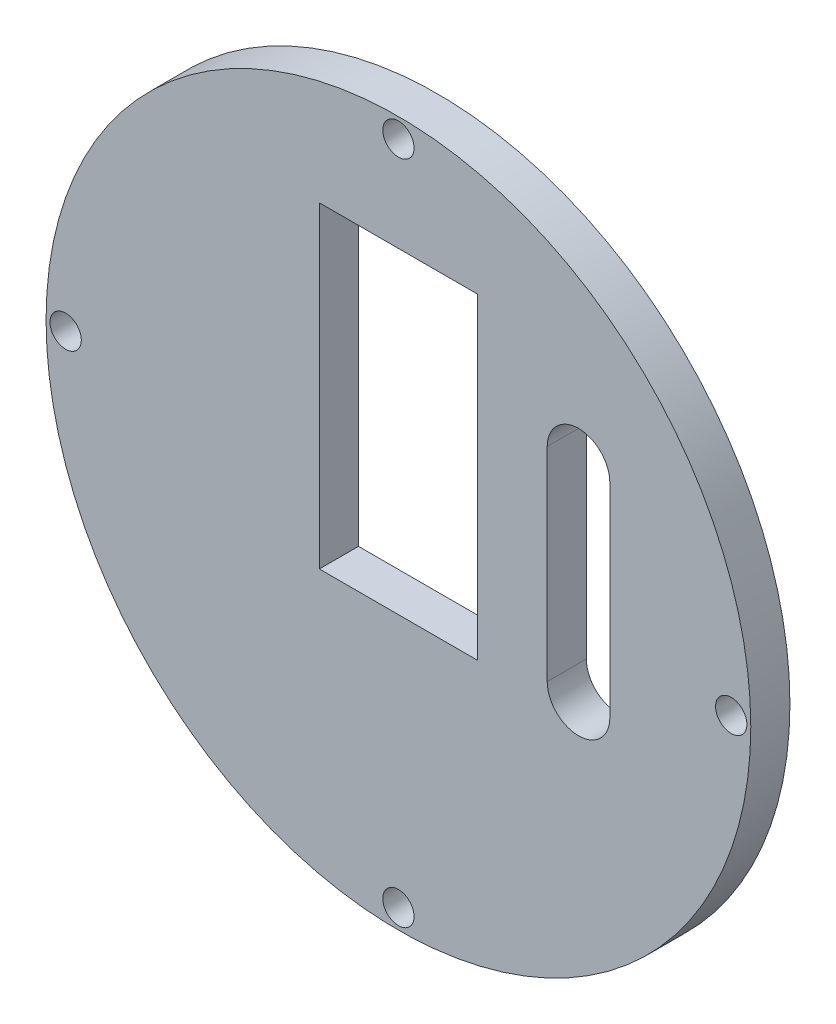
ISO-10303-21;
HEADER;
FILE_DESCRIPTION(('STEP AP214'),'2;1');
FILE_NAME('part.step','',(''),(''),'','','');
FILE_SCHEMA(('AUTOMOTIVE_DESIGN { 1 0 10303 214 1 1 1 1 }'));
ENDSEC;
DATA;
#1=APPLICATION_CONTEXT('core data for automotive mechanical design processes');
#2=APPLICATION_PROTOCOL_DEFINITION('international standard','automotive_design',2000,#1);
#3=PRODUCT_CONTEXT('',#1,'mechanical');
#4=PRODUCT('Part','Part','',(#3));
#5=PRODUCT_RELATED_PRODUCT_CATEGORY('part','',(#4));
#6=PRODUCT_DEFINITION_FORMATION('','',#4);
#7=PRODUCT_DEFINITION_CONTEXT('part definition',#1,'design');
#8=PRODUCT_DEFINITION('design','',#6,#7);
#9=PRODUCT_DEFINITION_SHAPE('','',#8);
#10=(LENGTH_UNIT() NAMED_UNIT(*) SI_UNIT(.MILLI.,.METRE.));
#11=(NAMED_UNIT(*) PLANE_ANGLE_UNIT() SI_UNIT($,.RADIAN.));
#12=(NAMED_UNIT(*) SI_UNIT($,.STERADIAN.) SOLID_ANGLE_UNIT());
#13=UNCERTAINTY_MEASURE_WITH_UNIT(LENGTH_MEASURE(1.E-05),#10,'distance_accuracy_value','');
#14=(GEOMETRIC_REPRESENTATION_CONTEXT(3) GLOBAL_UNCERTAINTY_ASSIGNED_CONTEXT((#13)) GLOBAL_UNIT_ASSIGNED_CONTEXT((#10,
#11,#12)) REPRESENTATION_CONTEXT('',''));
#15=CARTESIAN_POINT('',(0.,0.,0.));
#16=DIRECTION('',(0.,0.,1.));
#17=DIRECTION('',(1.,0.,0.));
#18=AXIS2_PLACEMENT_3D('',#15,#16,#17);
#19=CARTESIAN_POINT('',(0.,30.4,5.));
#20=DIRECTION('',(0.,1.,0.));
#21=DIRECTION('',(0.,0.,1.));
#22=AXIS2_PLACEMENT_3D('',#19,#20,#21);
#23=PLANE('',#22);
#24=DIRECTION('',(1.,0.,0.));
#25=VECTOR('',#24,1.);
#26=CARTESIAN_POINT('',(0.,30.4,0.));
#27=LINE('',#26,#25);
#28=CARTESIAN_POINT('',(-10.1,30.4,0.));
#29=VERTEX_POINT('',#28);
#30=CARTESIAN_POINT('',(10.1,30.4,0.));
#31=VERTEX_POINT('',#30);
#32=EDGE_CURVE('E186',#29,#31,#27,.T.);
#33=ORIENTED_EDGE('',*,*,#32,.T.);
#34=DIRECTION('',(0.,0.,-1.));
#35=VECTOR('',#34,1.);
#36=CARTESIAN_POINT('',(10.1,30.4,5.));
#37=LINE('',#36,#35);
#38=CARTESIAN_POINT('',(10.1,30.4,5.));
#39=VERTEX_POINT('',#38);
#40=EDGE_CURVE('E13',#39,#31,#37,.T.);
#41=ORIENTED_EDGE('',*,*,#40,.F.);
#42=DIRECTION('',(1.,0.,0.));
#43=VECTOR('',#42,1.);
#44=CARTESIAN_POINT('',(0.,30.4,5.));
#45=LINE('',#44,#43);
#46=CARTESIAN_POINT('',(-10.1,30.4,5.));
#47=VERTEX_POINT('',#46);
#48=EDGE_CURVE('E160',#47,#39,#45,.T.);
#49=ORIENTED_EDGE('',*,*,#48,.F.);
#50=DIRECTION('',(0.,0.,-1.));
#51=VECTOR('',#50,1.);
#52=CARTESIAN_POINT('',(-10.1,30.4,5.));
#53=LINE('',#52,#51);
#54=EDGE_CURVE('E174',#47,#29,#53,.T.);
#55=ORIENTED_EDGE('',*,*,#54,.T.);
#56=EDGE_LOOP('',(#33,#41,#49,#55));
#57=FACE_BOUND('',#56,.T.);
#58=ADVANCED_FACE('F46',(#57),#23,.F.);
#59=CARTESIAN_POINT('',(10.1,0.,5.));
#60=DIRECTION('',(1.,0.,0.));
#61=DIRECTION('',(0.,1.,0.));
#62=AXIS2_PLACEMENT_3D('',#59,#60,#61);
#63=PLANE('',#62);
#64=DIRECTION('',(0.,-1.,0.));
#65=VECTOR('',#64,1.);
#66=CARTESIAN_POINT('',(10.1,0.,0.));
#67=LINE('',#66,#65);
#68=CARTESIAN_POINT('',(10.1,-10.1,0.));
#69=VERTEX_POINT('',#68);
#70=EDGE_CURVE('E189',#31,#69,#67,.T.);
#71=ORIENTED_EDGE('',*,*,#70,.T.);
#72=DIRECTION('',(0.,0.,-1.));
#73=VECTOR('',#72,1.);
#74=CARTESIAN_POINT('',(10.1,-10.1,5.));
#75=LINE('',#74,#73);
#76=CARTESIAN_POINT('',(10.1,-10.1,5.));
#77=VERTEX_POINT('',#76);
#78=EDGE_CURVE('E54',#77,#69,#75,.T.);
#79=ORIENTED_EDGE('',*,*,#78,.F.);
#80=DIRECTION('',(0.,-1.,0.));
#81=VECTOR('',#80,1.);
#82=CARTESIAN_POINT('',(10.1,0.,5.));
#83=LINE('',#82,#81);
#84=EDGE_CURVE('E163',#39,#77,#83,.T.);
#85=ORIENTED_EDGE('',*,*,#84,.F.);
#86=ORIENTED_EDGE('',*,*,#40,.T.);
#87=EDGE_LOOP('',(#71,#79,#85,#86));
#88=FACE_BOUND('',#87,.T.);
#89=ADVANCED_FACE('F208',(#88),#63,.F.);
#90=CARTESIAN_POINT('',(0.,-10.1,5.));
#91=DIRECTION('',(0.,1.,0.));
#92=DIRECTION('',(0.,0.,1.));
#93=AXIS2_PLACEMENT_3D('',#90,#91,#92);
#94=PLANE('',#93);
#95=DIRECTION('',(1.,0.,0.));
#96=VECTOR('',#95,1.);
#97=CARTESIAN_POINT('',(0.,-10.1,0.));
#98=LINE('',#97,#96);
#99=CARTESIAN_POINT('',(-10.1,-10.1,0.));
#100=VERTEX_POINT('',#99);
#101=EDGE_CURVE('E192',#100,#69,#98,.T.);
#102=ORIENTED_EDGE('',*,*,#101,.F.);
#103=DIRECTION('',(0.,0.,-1.));
#104=VECTOR('',#103,1.);
#105=CARTESIAN_POINT('',(-10.1,-10.1,5.));
#106=LINE('',#105,#104);
#107=CARTESIAN_POINT('',(-10.1,-10.1,5.));
#108=VERTEX_POINT('',#107);
#109=EDGE_CURVE('E201',#108,#100,#106,.T.);
#110=ORIENTED_EDGE('',*,*,#109,.F.);
#111=DIRECTION('',(1.,0.,0.));
#112=VECTOR('',#111,1.);
#113=CARTESIAN_POINT('',(0.,-10.1,5.));
#114=LINE('',#113,#112);
#115=EDGE_CURVE('E165',#108,#77,#114,.T.);
#116=ORIENTED_EDGE('',*,*,#115,.T.);
#117=ORIENTED_EDGE('',*,*,#78,.T.);
#118=EDGE_LOOP('',(#102,#110,#116,#117));
#119=FACE_BOUND('',#118,.T.);
#120=ADVANCED_FACE('F205',(#119),#94,.T.);
#121=CARTESIAN_POINT('',(-10.1,0.,5.));
#122=DIRECTION('',(1.,0.,0.));
#123=DIRECTION('',(0.,1.,0.));
#124=AXIS2_PLACEMENT_3D('',#121,#122,#123);
#125=PLANE('',#124);
#126=DIRECTION('',(0.,-1.,0.));
#127=VECTOR('',#126,1.);
#128=CARTESIAN_POINT('',(-10.1,0.,0.));
#129=LINE('',#128,#127);
#130=EDGE_CURVE('E195',#29,#100,#129,.T.);
#131=ORIENTED_EDGE('',*,*,#130,.F.);
#132=ORIENTED_EDGE('',*,*,#54,.F.);
#133=DIRECTION('',(0.,-1.,0.));
#134=VECTOR('',#133,1.);
#135=CARTESIAN_POINT('',(-10.1,0.,5.));
#136=LINE('',#135,#134);
#137=EDGE_CURVE('E168',#47,#108,#136,.T.);
#138=ORIENTED_EDGE('',*,*,#137,.T.);
#139=ORIENTED_EDGE('',*,*,#109,.T.);
#140=EDGE_LOOP('',(#131,#132,#138,#139));
#141=FACE_BOUND('',#140,.T.);
#142=ADVANCED_FACE('F215',(#141),#125,.T.);
#143=CARTESIAN_POINT('',(42.5,0.,5.));
#144=DIRECTION('',(0.,0.,-1.));
#145=DIRECTION('',(-1.,0.,0.));
#146=AXIS2_PLACEMENT_3D('',#143,#144,#145);
#147=CYLINDRICAL_SURFACE('',#146,2.);
#148=CARTESIAN_POINT('',(42.5,0.,5.));
#149=DIRECTION('',(0.,0.,1.));
#150=DIRECTION('',(1.,0.,0.));
#151=AXIS2_PLACEMENT_3D('',#148,#149,#150);
#152=CIRCLE('',#151,2.);
#153=CARTESIAN_POINT('',(44.5,0.,5.));
#154=VERTEX_POINT('',#153);
#155=EDGE_CURVE('E157',#154,#154,#152,.T.);
#156=ORIENTED_EDGE('',*,*,#155,.T.);
#157=EDGE_LOOP('',(#156));
#158=FACE_BOUND('',#157,.T.);
#159=CARTESIAN_POINT('',(42.5,0.,0.));
#160=DIRECTION('',(0.,0.,1.));
#161=DIRECTION('',(1.,0.,0.));
#162=AXIS2_PLACEMENT_3D('',#159,#160,#161);
#163=CIRCLE('',#162,2.);
#164=CARTESIAN_POINT('',(44.5,0.,0.));
#165=VERTEX_POINT('',#164);
#166=EDGE_CURVE('E183',#165,#165,#163,.T.);
#167=ORIENTED_EDGE('',*,*,#166,.F.);
#168=EDGE_LOOP('',(#167));
#169=FACE_BOUND('',#168,.T.);
#170=ADVANCED_FACE('F230',(#158,#169),#147,.F.);
#171=CARTESIAN_POINT('',(0.,-42.5,5.));
#172=DIRECTION('',(0.,0.,-1.));
#173=DIRECTION('',(-1.,0.,0.));
#174=AXIS2_PLACEMENT_3D('',#171,#172,#173);
#175=CYLINDRICAL_SURFACE('',#174,2.);
#176=CARTESIAN_POINT('',(0.,-42.5,5.));
#177=DIRECTION('',(0.,0.,1.));
#178=DIRECTION('',(1.,0.,0.));
#179=AXIS2_PLACEMENT_3D('',#176,#177,#178);
#180=CIRCLE('',#179,2.);
#181=CARTESIAN_POINT('',(2.00000000000001,-42.5,5.));
#182=VERTEX_POINT('',#181);
#183=EDGE_CURVE('E154',#182,#182,#180,.T.);
#184=ORIENTED_EDGE('',*,*,#183,.T.);
#185=EDGE_LOOP('',(#184));
#186=FACE_BOUND('',#185,.T.);
#187=CARTESIAN_POINT('',(0.,-42.5,0.));
#188=DIRECTION('',(0.,0.,1.));
#189=DIRECTION('',(1.,0.,0.));
#190=AXIS2_PLACEMENT_3D('',#187,#188,#189);
#191=CIRCLE('',#190,2.);
#192=CARTESIAN_POINT('',(2.00000000000001,-42.5,0.));
#193=VERTEX_POINT('',#192);
#194=EDGE_CURVE('E180',#193,#193,#191,.T.);
#195=ORIENTED_EDGE('',*,*,#194,.F.);
#196=EDGE_LOOP('',(#195));
#197=FACE_BOUND('',#196,.T.);
#198=ADVANCED_FACE('F233',(#186,#197),#175,.F.);
#199=CARTESIAN_POINT('',(-42.5,0.,5.));
#200=DIRECTION('',(0.,0.,-1.));
#201=DIRECTION('',(-1.,0.,0.));
#202=AXIS2_PLACEMENT_3D('',#199,#200,#201);
#203=CYLINDRICAL_SURFACE('',#202,2.);
#204=CARTESIAN_POINT('',(-42.5,0.,5.));
#205=DIRECTION('',(0.,0.,1.));
#206=DIRECTION('',(1.,0.,0.));
#207=AXIS2_PLACEMENT_3D('',#204,#205,#206);
#208=CIRCLE('',#207,2.);
#209=CARTESIAN_POINT('',(-40.5,0.,5.));
#210=VERTEX_POINT('',#209);
#211=EDGE_CURVE('E150',#210,#210,#208,.T.);
#212=ORIENTED_EDGE('',*,*,#211,.T.);
#213=EDGE_LOOP('',(#212));
#214=FACE_BOUND('',#213,.T.);
#215=CARTESIAN_POINT('',(-42.5,0.,0.));
#216=DIRECTION('',(0.,0.,1.));
#217=DIRECTION('',(1.,0.,0.));
#218=AXIS2_PLACEMENT_3D('',#215,#216,#217);
#219=CIRCLE('',#218,2.);
#220=CARTESIAN_POINT('',(-40.5,0.,0.));
#221=VERTEX_POINT('',#220);
#222=EDGE_CURVE('E177',#221,#221,#219,.T.);
#223=ORIENTED_EDGE('',*,*,#222,.F.);
#224=EDGE_LOOP('',(#223));
#225=FACE_BOUND('',#224,.T.);
#226=ADVANCED_FACE('F236',(#214,#225),#203,.F.);
#227=CARTESIAN_POINT('',(0.,42.5,5.));
#228=DIRECTION('',(0.,0.,-1.));
#229=DIRECTION('',(-1.,0.,0.));
#230=AXIS2_PLACEMENT_3D('',#227,#228,#229);
#231=CYLINDRICAL_SURFACE('',#230,2.);
#232=CARTESIAN_POINT('',(0.,42.5,5.));
#233=DIRECTION('',(0.,0.,1.));
#234=DIRECTION('',(1.,0.,0.));
#235=AXIS2_PLACEMENT_3D('',#232,#233,#234);
#236=CIRCLE('',#235,2.);
#237=CARTESIAN_POINT('',(1.99999999999999,42.5,5.));
#238=VERTEX_POINT('',#237);
#239=EDGE_CURVE('E147',#238,#238,#236,.T.);
#240=ORIENTED_EDGE('',*,*,#239,.T.);
#241=EDGE_LOOP('',(#240));
#242=FACE_BOUND('',#241,.T.);
#243=CARTESIAN_POINT('',(0.,42.5,0.));
#244=DIRECTION('',(0.,0.,1.));
#245=DIRECTION('',(1.,0.,0.));
#246=AXIS2_PLACEMENT_3D('',#243,#244,#245);
#247=CIRCLE('',#246,2.);
#248=CARTESIAN_POINT('',(1.99999999999999,42.5,0.));
#249=VERTEX_POINT('',#248);
#250=EDGE_CURVE('E146',#249,#249,#247,.T.);
#251=ORIENTED_EDGE('',*,*,#250,.F.);
#252=EDGE_LOOP('',(#251));
#253=FACE_BOUND('',#252,.T.);
#254=ADVANCED_FACE('F48',(#242,#253),#231,.F.);
#255=CARTESIAN_POINT('',(0.,0.,5.));
#256=DIRECTION('',(0.,0.,-1.));
#257=DIRECTION('',(-1.,0.,0.));
#258=AXIS2_PLACEMENT_3D('',#255,#256,#257);
#259=CYLINDRICAL_SURFACE('',#258,45.);
#260=CARTESIAN_POINT('',(0.,0.,5.));
#261=DIRECTION('',(0.,0.,1.));
#262=DIRECTION('',(1.,0.,0.));
#263=AXIS2_PLACEMENT_3D('',#260,#261,#262);
#264=CIRCLE('',#263,45.);
#265=CARTESIAN_POINT('',(45.,0.,5.));
#266=VERTEX_POINT('',#265);
#267=EDGE_CURVE('E171',#266,#266,#264,.T.);
#268=ORIENTED_EDGE('',*,*,#267,.F.);
#269=EDGE_LOOP('',(#268));
#270=FACE_BOUND('',#269,.T.);
#271=CARTESIAN_POINT('',(0.,0.,0.));
#272=DIRECTION('',(0.,0.,1.));
#273=DIRECTION('',(1.,0.,0.));
#274=AXIS2_PLACEMENT_3D('',#271,#272,#273);
#275=CIRCLE('',#274,45.);
#276=CARTESIAN_POINT('',(45.,0.,0.));
#277=VERTEX_POINT('',#276);
#278=EDGE_CURVE('E151',#277,#277,#275,.T.);
#279=ORIENTED_EDGE('',*,*,#278,.T.);
#280=EDGE_LOOP('',(#279));
#281=FACE_BOUND('',#280,.T.);
#282=ADVANCED_FACE('F243',(#270,#281),#259,.T.);
#283=CARTESIAN_POINT('',(0.,0.,5.));
#284=DIRECTION('',(0.,0.,1.));
#285=DIRECTION('',(1.,0.,0.));
#286=AXIS2_PLACEMENT_3D('',#283,#284,#285);
#287=PLANE('',#286);
#288=CARTESIAN_POINT('',(23.,18.,5.));
#289=DIRECTION('',(0.,0.,1.));
#290=DIRECTION('',(1.,0.,0.));
#291=AXIS2_PLACEMENT_3D('',#288,#289,#290);
#292=CIRCLE('',#291,4.);
#293=CARTESIAN_POINT('',(27.,18.,5.));
#294=VERTEX_POINT('',#293);
#295=CARTESIAN_POINT('',(19.,18.,5.));
#296=VERTEX_POINT('',#295);
#297=EDGE_CURVE('E144',#294,#296,#292,.T.);
#298=ORIENTED_EDGE('',*,*,#297,.F.);
#299=DIRECTION('',(0.,1.,0.));
#300=VECTOR('',#299,1.);
#301=CARTESIAN_POINT('',(27.,0.,5.));
#302=LINE('',#301,#300);
#303=CARTESIAN_POINT('',(27.,-8.,5.));
#304=VERTEX_POINT('',#303);
#305=EDGE_CURVE('E137',#304,#294,#302,.T.);
#306=ORIENTED_EDGE('',*,*,#305,.F.);
#307=CARTESIAN_POINT('',(23.,-8.,5.));
#308=DIRECTION('',(0.,0.,1.));
#309=DIRECTION('',(1.,0.,0.));
#310=AXIS2_PLACEMENT_3D('',#307,#308,#309);
#311=CIRCLE('',#310,4.);
#312=CARTESIAN_POINT('',(19.,-8.,5.));
#313=VERTEX_POINT('',#312);
#314=EDGE_CURVE('E117',#313,#304,#311,.T.);
#315=ORIENTED_EDGE('',*,*,#314,.F.);
#316=DIRECTION('',(0.,-1.,0.));
#317=VECTOR('',#316,1.);
#318=CARTESIAN_POINT('',(19.,0.,5.));
#319=LINE('',#318,#317);
#320=EDGE_CURVE('E142',#296,#313,#319,.T.);
#321=ORIENTED_EDGE('',*,*,#320,.F.);
#322=EDGE_LOOP('',(#298,#306,#315,#321));
#323=FACE_BOUND('',#322,.T.);
#324=ORIENTED_EDGE('',*,*,#239,.F.);
#325=EDGE_LOOP('',(#324));
#326=FACE_BOUND('',#325,.T.);
#327=ORIENTED_EDGE('',*,*,#211,.F.);
#328=EDGE_LOOP('',(#327));
#329=FACE_BOUND('',#328,.T.);
#330=ORIENTED_EDGE('',*,*,#183,.F.);
#331=EDGE_LOOP('',(#330));
#332=FACE_BOUND('',#331,.T.);
#333=ORIENTED_EDGE('',*,*,#155,.F.);
#334=EDGE_LOOP('',(#333));
#335=FACE_BOUND('',#334,.T.);
#336=ORIENTED_EDGE('',*,*,#48,.T.);
#337=ORIENTED_EDGE('',*,*,#84,.T.);
#338=ORIENTED_EDGE('',*,*,#115,.F.);
#339=ORIENTED_EDGE('',*,*,#137,.F.);
#340=EDGE_LOOP('',(#336,#337,#338,#339));
#341=FACE_BOUND('',#340,.T.);
#342=ORIENTED_EDGE('',*,*,#267,.T.);
#343=EDGE_LOOP('',(#342));
#344=FACE_BOUND('',#343,.T.);
#345=ADVANCED_FACE('F219',(#323,#326,#329,#332,#335,#341,#344),#287,.T.);
#346=CARTESIAN_POINT('',(0.,0.,0.));
#347=DIRECTION('',(0.,0.,1.));
#348=DIRECTION('',(1.,0.,0.));
#349=AXIS2_PLACEMENT_3D('',#346,#347,#348);
#350=PLANE('',#349);
#351=DIRECTION('',(0.,-1.,0.));
#352=VECTOR('',#351,1.);
#353=CARTESIAN_POINT('',(27.,18.,0.));
#354=LINE('',#353,#352);
#355=CARTESIAN_POINT('',(27.,18.,0.));
#356=VERTEX_POINT('',#355);
#357=CARTESIAN_POINT('',(27.,-8.,0.));
#358=VERTEX_POINT('',#357);
#359=EDGE_CURVE('E123',#356,#358,#354,.T.);
#360=ORIENTED_EDGE('',*,*,#359,.F.);
#361=CARTESIAN_POINT('',(23.,18.,0.));
#362=DIRECTION('',(0.,0.,-1.));
#363=DIRECTION('',(-1.,0.,0.));
#364=AXIS2_PLACEMENT_3D('',#361,#362,#363);
#365=CIRCLE('',#364,4.);
#366=CARTESIAN_POINT('',(19.,18.,0.));
#367=VERTEX_POINT('',#366);
#368=EDGE_CURVE('E69',#367,#356,#365,.T.);
#369=ORIENTED_EDGE('',*,*,#368,.F.);
#370=DIRECTION('',(0.,1.,0.));
#371=VECTOR('',#370,1.);
#372=CARTESIAN_POINT('',(19.,18.,0.));
#373=LINE('',#372,#371);
#374=CARTESIAN_POINT('',(19.,-8.,0.));
#375=VERTEX_POINT('',#374);
#376=EDGE_CURVE('E130',#375,#367,#373,.T.);
#377=ORIENTED_EDGE('',*,*,#376,.F.);
#378=CARTESIAN_POINT('',(23.,-8.,0.));
#379=DIRECTION('',(0.,0.,-1.));
#380=DIRECTION('',(-1.,0.,0.));
#381=AXIS2_PLACEMENT_3D('',#378,#379,#380);
#382=CIRCLE('',#381,4.);
#383=EDGE_CURVE('E114',#358,#375,#382,.T.);
#384=ORIENTED_EDGE('',*,*,#383,.F.);
#385=EDGE_LOOP('',(#360,#369,#377,#384));
#386=FACE_BOUND('',#385,.T.);
#387=ORIENTED_EDGE('',*,*,#250,.T.);
#388=EDGE_LOOP('',(#387));
#389=FACE_BOUND('',#388,.T.);
#390=ORIENTED_EDGE('',*,*,#222,.T.);
#391=EDGE_LOOP('',(#390));
#392=FACE_BOUND('',#391,.T.);
#393=ORIENTED_EDGE('',*,*,#194,.T.);
#394=EDGE_LOOP('',(#393));
#395=FACE_BOUND('',#394,.T.);
#396=ORIENTED_EDGE('',*,*,#166,.T.);
#397=EDGE_LOOP('',(#396));
#398=FACE_BOUND('',#397,.T.);
#399=ORIENTED_EDGE('',*,*,#32,.F.);
#400=ORIENTED_EDGE('',*,*,#130,.T.);
#401=ORIENTED_EDGE('',*,*,#101,.T.);
#402=ORIENTED_EDGE('',*,*,#70,.F.);
#403=EDGE_LOOP('',(#399,#400,#401,#402));
#404=FACE_BOUND('',#403,.T.);
#405=ORIENTED_EDGE('',*,*,#278,.F.);
#406=EDGE_LOOP('',(#405));
#407=FACE_BOUND('',#406,.T.);
#408=ADVANCED_FACE('F127',(#386,#389,#392,#395,#398,#404,#407),#350,.F.);
#409=CARTESIAN_POINT('',(23.,18.,10.));
#410=DIRECTION('',(0.,0.,-1.));
#411=DIRECTION('',(-1.,0.,0.));
#412=AXIS2_PLACEMENT_3D('',#409,#410,#411);
#413=CYLINDRICAL_SURFACE('',#412,4.);
#414=ORIENTED_EDGE('',*,*,#297,.T.);
#415=DIRECTION('',(0.,0.,-1.));
#416=VECTOR('',#415,1.);
#417=CARTESIAN_POINT('',(19.,18.,10.));
#418=LINE('',#417,#416);
#419=EDGE_CURVE('E135',#296,#367,#418,.T.);
#420=ORIENTED_EDGE('',*,*,#419,.T.);
#421=ORIENTED_EDGE('',*,*,#368,.T.);
#422=DIRECTION('',(0.,0.,-1.));
#423=VECTOR('',#422,1.);
#424=CARTESIAN_POINT('',(27.,18.,10.));
#425=LINE('',#424,#423);
#426=EDGE_CURVE('E120',#294,#356,#425,.T.);
#427=ORIENTED_EDGE('',*,*,#426,.F.);
#428=EDGE_LOOP('',(#414,#420,#421,#427));
#429=FACE_BOUND('',#428,.T.);
#430=ADVANCED_FACE('F251',(#429),#413,.F.);
#431=CARTESIAN_POINT('',(19.,18.,10.));
#432=DIRECTION('',(-1.,0.,0.));
#433=DIRECTION('',(0.,0.,1.));
#434=AXIS2_PLACEMENT_3D('',#431,#432,#433);
#435=PLANE('',#434);
#436=ORIENTED_EDGE('',*,*,#320,.T.);
#437=DIRECTION('',(0.,0.,-1.));
#438=VECTOR('',#437,1.);
#439=CARTESIAN_POINT('',(19.,-8.,10.));
#440=LINE('',#439,#438);
#441=EDGE_CURVE('E119',#313,#375,#440,.T.);
#442=ORIENTED_EDGE('',*,*,#441,.T.);
#443=ORIENTED_EDGE('',*,*,#376,.T.);
#444=ORIENTED_EDGE('',*,*,#419,.F.);
#445=EDGE_LOOP('',(#436,#442,#443,#444));
#446=FACE_BOUND('',#445,.T.);
#447=ADVANCED_FACE('F263',(#446),#435,.F.);
#448=CARTESIAN_POINT('',(23.,-8.,10.));
#449=DIRECTION('',(0.,0.,-1.));
#450=DIRECTION('',(-1.,0.,0.));
#451=AXIS2_PLACEMENT_3D('',#448,#449,#450);
#452=CYLINDRICAL_SURFACE('',#451,4.);
#453=ORIENTED_EDGE('',*,*,#314,.T.);
#454=DIRECTION('',(0.,0.,-1.));
#455=VECTOR('',#454,1.);
#456=CARTESIAN_POINT('',(27.,-8.,10.));
#457=LINE('',#456,#455);
#458=EDGE_CURVE('E61',#304,#358,#457,.T.);
#459=ORIENTED_EDGE('',*,*,#458,.T.);
#460=ORIENTED_EDGE('',*,*,#383,.T.);
#461=ORIENTED_EDGE('',*,*,#441,.F.);
#462=EDGE_LOOP('',(#453,#459,#460,#461));
#463=FACE_BOUND('',#462,.T.);
#464=ADVANCED_FACE('F111',(#463),#452,.F.);
#465=CARTESIAN_POINT('',(27.,18.,10.));
#466=DIRECTION('',(1.,0.,0.));
#467=DIRECTION('',(0.,0.,-1.));
#468=AXIS2_PLACEMENT_3D('',#465,#466,#467);
#469=PLANE('',#468);
#470=ORIENTED_EDGE('',*,*,#305,.T.);
#471=ORIENTED_EDGE('',*,*,#426,.T.);
#472=ORIENTED_EDGE('',*,*,#359,.T.);
#473=ORIENTED_EDGE('',*,*,#458,.F.);
#474=EDGE_LOOP('',(#470,#471,#472,#473));
#475=FACE_BOUND('',#474,.T.);
#476=ADVANCED_FACE('F124',(#475),#469,.F.);
#477=CLOSED_SHELL('',(#58,#89,#120,#142,#170,#198,#226,#254,#282,#345,#408,#430,#447,#464,#476));
#478=MANIFOLD_SOLID_BREP('B2',#477);
#479=ADVANCED_BREP_SHAPE_REPRESENTATION('',(#18,#478),#14);
#480=SHAPE_DEFINITION_REPRESENTATION(#9,#479);
ENDSEC;
END-ISO-10303-21;
